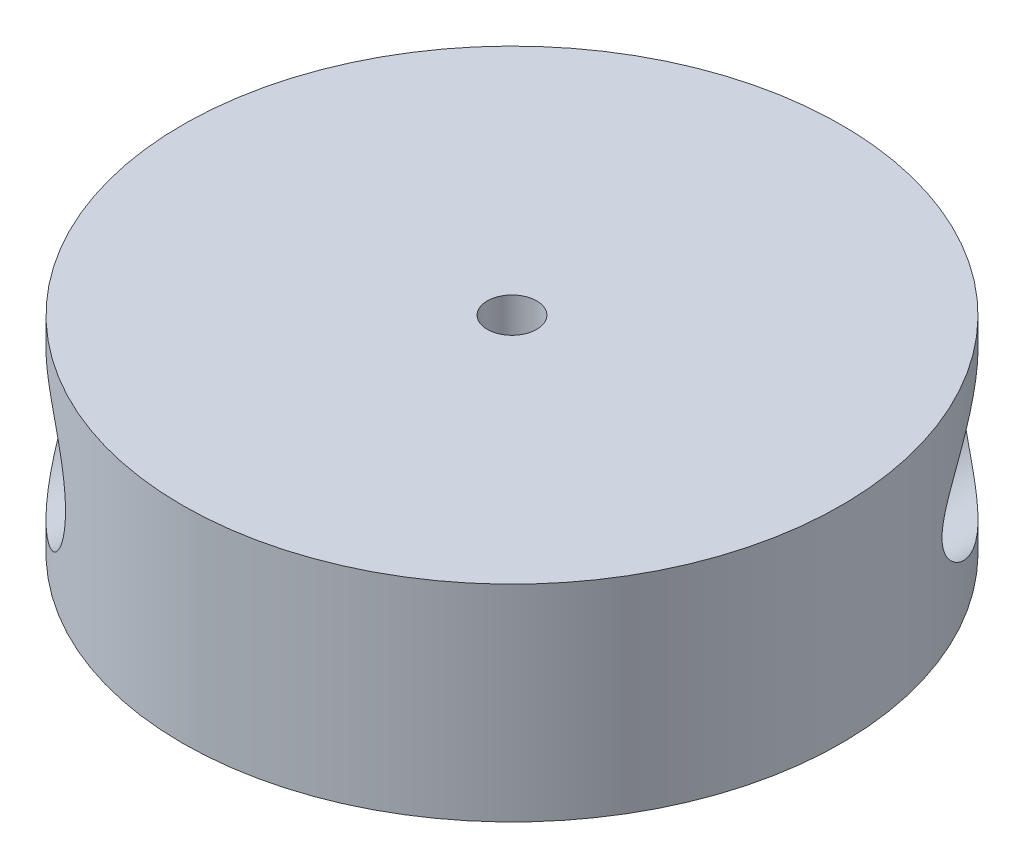
ISO-10303-21;
HEADER;
FILE_DESCRIPTION(('STEP AP214'),'2;1');
FILE_NAME('part.step','',(''),(''),'','','');
FILE_SCHEMA(('AUTOMOTIVE_DESIGN { 1 0 10303 214 1 1 1 1 }'));
ENDSEC;
DATA;
#1=APPLICATION_CONTEXT('core data for automotive mechanical design processes');
#2=APPLICATION_PROTOCOL_DEFINITION('international standard','automotive_design',2000,#1);
#3=PRODUCT_CONTEXT('',#1,'mechanical');
#4=PRODUCT('Part','Part','',(#3));
#5=PRODUCT_RELATED_PRODUCT_CATEGORY('part','',(#4));
#6=PRODUCT_DEFINITION_FORMATION('','',#4);
#7=PRODUCT_DEFINITION_CONTEXT('part definition',#1,'design');
#8=PRODUCT_DEFINITION('design','',#6,#7);
#9=PRODUCT_DEFINITION_SHAPE('','',#8);
#10=(LENGTH_UNIT() NAMED_UNIT(*) SI_UNIT(.MILLI.,.METRE.));
#11=(NAMED_UNIT(*) PLANE_ANGLE_UNIT() SI_UNIT($,.RADIAN.));
#12=(NAMED_UNIT(*) SI_UNIT($,.STERADIAN.) SOLID_ANGLE_UNIT());
#13=UNCERTAINTY_MEASURE_WITH_UNIT(LENGTH_MEASURE(1.E-05),#10,'distance_accuracy_value','');
#14=(GEOMETRIC_REPRESENTATION_CONTEXT(3) GLOBAL_UNCERTAINTY_ASSIGNED_CONTEXT((#13)) GLOBAL_UNIT_ASSIGNED_CONTEXT((#10,
#11,#12)) REPRESENTATION_CONTEXT('',''));
#15=CARTESIAN_POINT('',(0.,0.,0.));
#16=DIRECTION('',(0.,0.,1.));
#17=DIRECTION('',(1.,0.,0.));
#18=AXIS2_PLACEMENT_3D('',#15,#16,#17);
#19=CARTESIAN_POINT('',(0.,25.,0.));
#20=DIRECTION('',(0.,-1.,0.));
#21=DIRECTION('',(0.,0.,-1.));
#22=AXIS2_PLACEMENT_3D('',#19,#20,#21);
#23=CYLINDRICAL_SURFACE('',#22,40.);
#24=CARTESIAN_POINT('',(37.,12.5,-15.1986841535707));
#25=CARTESIAN_POINT('',(37.0000045072031,12.6108431152836,-15.1986713501379));
#26=CARTESIAN_POINT('',(36.9979472042589,12.7216400331114,-15.2036843253257));
#27=CARTESIAN_POINT('',(36.9898067854234,12.9422171858196,-15.2234788612822));
#28=CARTESIAN_POINT('',(36.9837231433624,13.0519972859186,-15.238261698795));
#29=CARTESIAN_POINT('',(36.959660736741,13.3786569544393,-15.2965792674699));
#30=CARTESIAN_POINT('',(36.9358708699026,13.5927040040138,-15.3540819302438));
#31=CARTESIAN_POINT('',(36.8659339826997,14.0718905655712,-15.5213784364414));
#32=CARTESIAN_POINT('',(36.8151609285029,14.332494329502,-15.6418160927595));
#33=CARTESIAN_POINT('',(36.6968331729873,14.8304450421458,-15.9174412353892));
#34=CARTESIAN_POINT('',(36.6292340779595,15.067728113975,-16.0727205391179));
#35=CARTESIAN_POINT('',(36.4862369860393,15.505504766104,-16.3946173663222));
#36=CARTESIAN_POINT('',(36.4116847102366,15.7074035772001,-16.5597404969942));
#37=CARTESIAN_POINT('',(36.2532952809628,16.0954224472309,-16.9036825639029));
#38=CARTESIAN_POINT('',(36.1694497798853,16.2815280507086,-17.0825137681726));
#39=CARTESIAN_POINT('',(35.9935827506881,16.6403643677001,-17.4500322766115));
#40=CARTESIAN_POINT('',(35.9015445809349,16.8130664594454,-17.6387393057319));
#41=CARTESIAN_POINT('',(35.7101914092421,17.1464926485604,-18.0229946473029));
#42=CARTESIAN_POINT('',(35.6108738262538,17.3072124562503,-18.2185453733443));
#43=CARTESIAN_POINT('',(35.4042343712699,17.619848076733,-18.6169594498047));
#44=CARTESIAN_POINT('',(35.2968290376024,17.7716312055275,-18.8198831762293));
#45=CARTESIAN_POINT('',(35.075471446199,18.0652031480908,-19.2292866519795));
#46=CARTESIAN_POINT('',(34.9615199891015,18.2069931793842,-19.4357659642774));
#47=CARTESIAN_POINT('',(34.7271905337633,18.4814286233928,-19.8514282049718));
#48=CARTESIAN_POINT('',(34.6068073575338,18.6140664649529,-20.0606132057521));
#49=CARTESIAN_POINT('',(34.3598520079031,18.8705538696378,-20.4807224405254));
#50=CARTESIAN_POINT('',(34.2332791570174,18.9944024670917,-20.6916468627949));
#51=CARTESIAN_POINT('',(33.8440834379609,19.3535840207692,-21.3266144526233));
#52=CARTESIAN_POINT('',(33.5722819872924,19.57620555856,-21.7523197944948));
#53=CARTESIAN_POINT('',(33.0050338548782,19.9881478310489,-22.6037509865158));
#54=CARTESIAN_POINT('',(32.7095950180221,20.1774795479741,-23.0294767833815));
#55=CARTESIAN_POINT('',(32.0780193193993,20.5316970995935,-23.9020253917821));
#56=CARTESIAN_POINT('',(31.7405256445785,20.6945942718323,-24.3486793476578));
#57=CARTESIAN_POINT('',(31.0401674045763,20.979403502543,-25.2354368619433));
#58=CARTESIAN_POINT('',(30.6772956087588,21.1013038224126,-25.6755385098191));
#59=CARTESIAN_POINT('',(29.9286616581291,21.2994191164271,-26.544361397381));
#60=CARTESIAN_POINT('',(29.5429670944621,21.3757622328435,-26.9731112851089));
#61=CARTESIAN_POINT('',(28.7502108057911,21.4775661787402,-27.8165356480106));
#62=CARTESIAN_POINT('',(28.3431636883577,21.5030613398705,-28.2312194342909));
#63=CARTESIAN_POINT('',(27.6681132214038,21.4976153844168,-28.8895665120327));
#64=CARTESIAN_POINT('',(27.4054019322987,21.4842956619246,-29.1388854043008));
#65=CARTESIAN_POINT('',(26.874604765197,21.4333387537765,-29.6291405367339));
#66=CARTESIAN_POINT('',(26.6065203974198,21.3957083108113,-29.8700790817062));
#67=CARTESIAN_POINT('',(26.0670049510278,21.2942483441872,-30.342043679682));
#68=CARTESIAN_POINT('',(25.7955771962993,21.2304430786658,-30.5730786926289));
#69=CARTESIAN_POINT('',(25.2514799115264,21.0747109722143,-31.0239826062772));
#70=CARTESIAN_POINT('',(24.9788105907893,20.9827887101597,-31.2438533183012));
#71=CARTESIAN_POINT('',(24.4847684180731,20.7885569345845,-31.6318835487794));
#72=CARTESIAN_POINT('',(24.2631087315575,20.6911984622575,-31.8021613270342));
#73=CARTESIAN_POINT('',(23.8228781083333,20.4756934998387,-32.1332581965372));
#74=CARTESIAN_POINT('',(23.6043065013825,20.3575515978897,-32.2940793649899));
#75=CARTESIAN_POINT('',(23.172410198365,20.0998429161509,-32.6053719022818));
#76=CARTESIAN_POINT('',(22.9590859086749,19.9602744830136,-32.7558424711333));
#77=CARTESIAN_POINT('',(22.5401883368044,19.6593957810268,-33.0454952290686));
#78=CARTESIAN_POINT('',(22.3346151680431,19.4980851941904,-33.1846772530055));
#79=CARTESIAN_POINT('',(21.932188727173,19.1522669751476,-33.4520249274819));
#80=CARTESIAN_POINT('',(21.7354278686126,18.9675680988927,-33.5800831188852));
#81=CARTESIAN_POINT('',(21.3555329163541,18.5766220521075,-33.8229516691135));
#82=CARTESIAN_POINT('',(21.1723993013604,18.370374125203,-33.9377615626237));
#83=CARTESIAN_POINT('',(20.8229183561417,17.9375378182738,-34.1533046269422));
#84=CARTESIAN_POINT('',(20.6565602321992,17.7109626968792,-34.2540468654534));
#85=CARTESIAN_POINT('',(20.3434937410878,17.2389930423448,-34.4408989035268));
#86=CARTESIAN_POINT('',(20.1967814870339,16.9936022469912,-34.5270115984152));
#87=CARTESIAN_POINT('',(19.9459515676704,16.5239622342082,-34.6724213547214));
#88=CARTESIAN_POINT('',(19.838744250121,16.3020005525501,-34.733801925554));
#89=CARTESIAN_POINT('',(19.6420982170133,15.8476452016096,-34.8453837416828));
#90=CARTESIAN_POINT('',(19.5526574395292,15.6152527467305,-34.8955862843458));
#91=CARTESIAN_POINT('',(19.3928987281098,15.1419988177376,-34.9846230369219));
#92=CARTESIAN_POINT('',(19.3225716950115,14.9011414352712,-35.0234626568686));
#93=CARTESIAN_POINT('',(19.2020451311343,14.4129034102075,-35.089688024084));
#94=CARTESIAN_POINT('',(19.1518443351186,14.1655231787119,-35.1170744913602));
#95=CARTESIAN_POINT('',(19.0761374349304,13.690339004831,-35.158251415114));
#96=CARTESIAN_POINT('',(19.0487280967915,13.4629267172384,-35.1730920335619));
#97=CARTESIAN_POINT('',(19.0113311020144,13.0062649146192,-35.1933196541369));
#98=CARTESIAN_POINT('',(19.0013421685075,12.777015535484,-35.1987073491381));
#99=CARTESIAN_POINT('',(18.9989110187242,12.3184552859338,-35.2000196117023));
#100=CARTESIAN_POINT('',(19.0064644870712,12.0891444445139,-35.1959465065929));
#101=CARTESIAN_POINT('',(19.0390136400899,11.6321279387729,-35.1783498954311));
#102=CARTESIAN_POINT('',(19.0640093346794,11.4044222753646,-35.164826384005));
#103=CARTESIAN_POINT('',(19.1302019567802,10.9585476152475,-35.1288591457952));
#104=CARTESIAN_POINT('',(19.1709338303101,10.7402886677646,-35.1066712913861));
#105=CARTESIAN_POINT('',(19.268109448738,10.308407870724,-35.0534309875676));
#106=CARTESIAN_POINT('',(19.3245527424073,10.0947858881837,-35.0223787927394));
#107=CARTESIAN_POINT('',(19.4524887778917,9.67360812450569,-34.9514809759876));
#108=CARTESIAN_POINT('',(19.5239809666768,9.46605212076921,-34.9116356771982));
#109=CARTESIAN_POINT('',(19.6811933854186,9.05831420702551,-34.8232501692938));
#110=CARTESIAN_POINT('',(19.7669139073819,8.85813244846213,-34.7747097817288));
#111=CARTESIAN_POINT('',(19.9533971464668,8.4625612548978,-34.6680500548595));
#112=CARTESIAN_POINT('',(20.0544178095868,8.26733841015929,-34.6097642104359));
#113=CARTESIAN_POINT('',(20.2690875492605,7.88689900168679,-34.4844824066083));
#114=CARTESIAN_POINT('',(20.3827366893247,7.70168248828308,-34.4174864033995));
#115=CARTESIAN_POINT('',(20.6214275435732,7.34216817341632,-34.275006021613));
#116=CARTESIAN_POINT('',(20.7464701228109,7.16787120272424,-34.1995209983996));
#117=CARTESIAN_POINT('',(21.0066419844635,6.83093861738803,-34.0403326749743));
#118=CARTESIAN_POINT('',(21.1417722770976,6.66830417387667,-33.9566285514072));
#119=CARTESIAN_POINT('',(21.4302627366067,6.34462116227357,-33.7753576773817));
#120=CARTESIAN_POINT('',(21.5842376965373,6.18443178389804,-33.6772353864629));
#121=CARTESIAN_POINT('',(21.9005351662477,5.87844760505177,-33.4724074202802));
#122=CARTESIAN_POINT('',(22.0628579887655,5.7326533444671,-33.3657014233582));
#123=CARTESIAN_POINT('',(22.3943020412543,5.4556543106577,-33.1441544031586));
#124=CARTESIAN_POINT('',(22.563424511992,5.32445221674202,-33.0293118922288));
#125=CARTESIAN_POINT('',(22.9069546970827,5.07667501847207,-32.7919963186145));
#126=CARTESIAN_POINT('',(23.0813630027431,4.96010155812467,-32.6695224006016));
#127=CARTESIAN_POINT('',(23.4570066370483,4.72721487036659,-32.4010618836761));
#128=CARTESIAN_POINT('',(23.658780937304,4.6129072825629,-32.2540889138823));
#129=CARTESIAN_POINT('',(24.0654589660152,4.40235640979585,-31.9518058750952));
#130=CARTESIAN_POINT('',(24.2703628730113,4.30611415963398,-31.7964953291717));
#131=CARTESIAN_POINT('',(24.6817909849732,4.13103992566455,-31.478196552103));
#132=CARTESIAN_POINT('',(24.8883159147716,4.05221625091535,-31.3152047015842));
#133=CARTESIAN_POINT('',(25.3015189895178,3.91129404116863,-30.9823110779873));
#134=CARTESIAN_POINT('',(25.5081971561604,3.84919869566456,-30.8124079942823));
#135=CARTESIAN_POINT('',(26.0301672858226,3.71214749122754,-30.3743332383091));
#136=CARTESIAN_POINT('',(26.3447780593407,3.64790941534553,-30.1019462332687));
#137=CARTESIAN_POINT('',(26.9681440471953,3.553786944403,-29.5447832382046));
#138=CARTESIAN_POINT('',(27.2768968045659,3.52391666372415,-29.2600022079178));
#139=CARTESIAN_POINT('',(27.8864648087216,3.4955372813486,-28.6796520533917));
#140=CARTESIAN_POINT('',(28.1872663353128,3.49707924309852,-28.3840661433973));
#141=CARTESIAN_POINT('',(28.778563043066,3.52885127857682,-27.7843794753909));
#142=CARTESIAN_POINT('',(29.0690583389557,3.55908103285222,-27.4802788122316));
#143=CARTESIAN_POINT('',(29.7375958429205,3.660796446404,-26.7580707262374));
#144=CARTESIAN_POINT('',(30.1109420960146,3.74297506459475,-26.3371015445488));
#145=CARTESIAN_POINT('',(30.8347326692886,3.94979230861812,-25.4859119498377));
#146=CARTESIAN_POINT('',(31.1851673555923,4.07444866040562,-25.0556877450271));
#147=CARTESIAN_POINT('',(31.8626880929815,4.36270936247262,-24.1882755905291));
#148=CARTESIAN_POINT('',(32.1897173872464,4.52640447885083,-23.7510736613961));
#149=CARTESIAN_POINT('',(32.8187654260242,4.89003888499048,-22.8739964449012));
#150=CARTESIAN_POINT('',(33.120791610024,5.08996733692103,-22.4341219948444));
#151=CARTESIAN_POINT('',(33.655587848611,5.49224286565266,-21.6217680752923));
#152=CARTESIAN_POINT('',(33.8919203141087,5.68964119510486,-21.2491675975308));
#153=CARTESIAN_POINT('',(34.3460101011823,6.11062171502132,-20.5070876523662));
#154=CARTESIAN_POINT('',(34.5637607266454,6.33421327612938,-20.1376093529167));
#155=CARTESIAN_POINT('',(34.8752938659011,6.69009781002409,-19.5897383862481));
#156=CARTESIAN_POINT('',(34.9764034384775,6.81183322913305,-19.4085894645883));
#157=CARTESIAN_POINT('',(35.1736667139573,7.06272229978002,-19.0487590870299));
#158=CARTESIAN_POINT('',(35.2698210094527,7.19187506036838,-18.8700773379665));
#159=CARTESIAN_POINT('',(35.4569076918545,7.45807847715172,-18.5161480295052));
#160=CARTESIAN_POINT('',(35.5478442512357,7.59512264200706,-18.3408978020368));
#161=CARTESIAN_POINT('',(35.7242837551183,7.87796252882122,-17.994811486061));
#162=CARTESIAN_POINT('',(35.8097879360095,8.02375624461812,-17.8239743984293));
#163=CARTESIAN_POINT('',(35.95117473114,8.28173309355913,-17.536556185572));
#164=CARTESIAN_POINT('',(36.0084969182743,8.39150495273535,-17.4185178590613));
#165=CARTESIAN_POINT('',(36.1199726962176,8.61646977833149,-17.1861620423436));
#166=CARTESIAN_POINT('',(36.1741264730102,8.73166242583687,-17.0718443339138));
#167=CARTESIAN_POINT('',(36.2791420258644,8.96834059467959,-16.8475289514741));
#168=CARTESIAN_POINT('',(36.329993886586,9.08984326092625,-16.7375446469227));
#169=CARTESIAN_POINT('',(36.4278505224338,9.3394147134312,-16.5234847563036));
#170=CARTESIAN_POINT('',(36.4748560595931,9.4674821908527,-16.4194080010909));
#171=CARTESIAN_POINT('',(36.5652508317941,9.73296936206456,-16.2171173691255));
#172=CARTESIAN_POINT('',(36.6085696308127,9.87050645997777,-16.1190249149973));
#173=CARTESIAN_POINT('',(36.6900325392796,10.1537159148516,-15.9327288583811));
#174=CARTESIAN_POINT('',(36.7281751043086,10.2993906816059,-15.8445282086413));
#175=CARTESIAN_POINT('',(36.7981638755316,10.598482710376,-15.6812941655718));
#176=CARTESIAN_POINT('',(36.8300409407918,10.751857102869,-15.6061964538611));
#177=CARTESIAN_POINT('',(36.8865666374854,11.0666627369438,-15.4721202178616));
#178=CARTESIAN_POINT('',(36.9112238784924,11.2280841114086,-15.4131225002388));
#179=CARTESIAN_POINT('',(36.9537988375809,11.5716558827789,-15.3107842331657));
#180=CARTESIAN_POINT('',(36.9709910386468,11.7544168266097,-15.2691409073662));
#181=CARTESIAN_POINT('',(36.9940838590503,12.124831595914,-15.2131112284517));
#182=CARTESIAN_POINT('',(36.9999923749696,12.312481906407,-15.1987058136917));
#183=CARTESIAN_POINT('',(37.,12.5,-15.1986841535707));
#184=B_SPLINE_CURVE_WITH_KNOTS('',3,(#24,#25,#26,#27,#28,#29,#30,#31,#32,#33,#34,#35,#36,#37,
#38,#39,#40,#41,#42,#43,#44,#45,#46,#47,#48,#49,#50,#51,#52,#53,#54,#55,#56,#57,#58,#59,#60,#61,
#62,#63,#64,#65,#66,#67,#68,#69,#70,#71,#72,#73,#74,#75,#76,#77,#78,#79,#80,#81,#82,#83,#84,#85,
#86,#87,#88,#89,#90,#91,#92,#93,#94,#95,#96,#97,#98,#99,#100,#101,#102,#103,#104,#105,#106,#107,
#108,#109,#110,#111,#112,#113,#114,#115,#116,#117,#118,#119,#120,#121,#122,#123,#124,#125,#126,
#127,#128,#129,#130,#131,#132,#133,#134,#135,#136,#137,#138,#139,#140,#141,#142,#143,#144,#145,
#146,#147,#148,#149,#150,#151,#152,#153,#154,#155,#156,#157,#158,#159,#160,#161,#162,#163,#164,
#165,#166,#167,#168,#169,#170,#171,#172,#173,#174,#175,#176,#177,#178,#179,#180,#181,#182,#183),
.UNSPECIFIED.,.T.,.F.,(4,2,2,2,2,2,2,2,2,2,2,2,2,2,2,2,2,2,2,2,2,2,2,2,2,2,2,2,2,2,2,2,2,2,2,2,
2,2,2,2,2,2,2,2,2,2,2,2,2,2,2,2,2,2,2,2,2,2,2,2,2,2,2,2,2,2,2,2,2,2,2,2,2,2,2,2,2,2,2,4),(0.,
0.332311931144482,0.664667298032812,1.32982631366192,2.19958112038131,3.07165546831538,
3.88428425508702,4.69764899067988,5.51270534269973,6.32805209902366,7.15343270482658,
7.97871257463345,8.80466716971599,9.63071237205942,11.2849033468909,12.9385475802406,
14.685733643279,16.4334195519069,18.1761661500472,19.9177356772774,21.0042059474841,
22.0903750094351,23.1755397044651,24.2605277735494,25.1476591083206,26.0345948454841,
26.9215990562008,27.8086162410869,28.7034218360685,29.5982588493905,30.492516381234,
31.3865967242809,32.1476362409452,32.9085873822171,33.6691756330499,34.4297160619685,
35.1174871161421,35.8052077564359,36.4927592374939,37.1803111094973,37.8489311667184,
38.5175320232941,39.1861083138215,39.8546983271608,40.5361671576588,41.2176394155182,
41.8991634577401,42.5807558419838,43.308677196807,44.0366258418157,44.7647079276406,
45.4928717642336,46.315737810026,47.1386509760739,47.9619558471616,48.785417582091,
50.0467303405803,51.3085609182139,52.5724428792388,53.8363107664686,55.5398076754647,
57.2440163259047,58.9522266111478,60.6599267907055,62.10908616589,63.5587655710776,
64.2802329451982,65.0016138392588,65.7224095866573,66.4430406914561,66.9561528207809,
67.469234800461,67.9837923497726,68.4982477069403,69.0209887289511,69.5438853785129,
70.0641382874163,70.5837682490242,71.1463485710325,71.7085350419468),.UNSPECIFIED.);
#185=CARTESIAN_POINT('',(37.,12.5,-15.1986841535707));
#186=VERTEX_POINT('',#185);
#187=EDGE_CURVE('E54',#186,#186,#184,.T.);
#188=ORIENTED_EDGE('',*,*,#187,.T.);
#189=EDGE_LOOP('',(#188));
#190=FACE_BOUND('',#189,.T.);
#191=CARTESIAN_POINT('',(0.,25.,0.));
#192=DIRECTION('',(0.,1.,0.));
#193=DIRECTION('',(0.,0.,1.));
#194=AXIS2_PLACEMENT_3D('',#191,#192,#193);
#195=CIRCLE('',#194,40.);
#196=CARTESIAN_POINT('',(0.,25.,40.));
#197=VERTEX_POINT('',#196);
#198=EDGE_CURVE('E46',#197,#197,#195,.T.);
#199=ORIENTED_EDGE('',*,*,#198,.F.);
#200=EDGE_LOOP('',(#199));
#201=FACE_BOUND('',#200,.T.);
#202=CARTESIAN_POINT('',(0.,0.,0.));
#203=DIRECTION('',(0.,1.,0.));
#204=DIRECTION('',(0.,0.,1.));
#205=AXIS2_PLACEMENT_3D('',#202,#203,#204);
#206=CIRCLE('',#205,40.);
#207=CARTESIAN_POINT('',(0.,0.,40.));
#208=VERTEX_POINT('',#207);
#209=EDGE_CURVE('E51',#208,#208,#206,.T.);
#210=ORIENTED_EDGE('',*,*,#209,.T.);
#211=EDGE_LOOP('',(#210));
#212=FACE_BOUND('',#211,.T.);
#213=CARTESIAN_POINT('',(-37.,12.5,15.1986841535707));
#214=CARTESIAN_POINT('',(-37.0000045072031,12.3891568847164,15.1986713501379));
#215=CARTESIAN_POINT('',(-36.9979472042589,12.2783599668886,15.2036843253257));
#216=CARTESIAN_POINT('',(-36.9898067854234,12.0577828141804,15.2234788612822));
#217=CARTESIAN_POINT('',(-36.9837231433624,11.9480027140814,15.238261698795));
#218=CARTESIAN_POINT('',(-36.959660736741,11.6213430455607,15.2965792674699));
#219=CARTESIAN_POINT('',(-36.9358708699026,11.4072959959862,15.3540819302438));
#220=CARTESIAN_POINT('',(-36.8659339826997,10.9281094344288,15.5213784364414));
#221=CARTESIAN_POINT('',(-36.8151609285029,10.667505670498,15.6418160927595));
#222=CARTESIAN_POINT('',(-36.6968331729873,10.1695549578542,15.9174412353892));
#223=CARTESIAN_POINT('',(-36.6292340779595,9.93227188602497,16.0727205391179));
#224=CARTESIAN_POINT('',(-36.4862369860393,9.49449523389601,16.3946173663222));
#225=CARTESIAN_POINT('',(-36.4116847102366,9.29259642279992,16.5597404969942));
#226=CARTESIAN_POINT('',(-36.2532952809628,8.90457755276911,16.9036825639029));
#227=CARTESIAN_POINT('',(-36.1694497798853,8.71847194929141,17.0825137681725));
#228=CARTESIAN_POINT('',(-35.9935827506881,8.35963563229991,17.4500322766115));
#229=CARTESIAN_POINT('',(-35.9015445809349,8.18693354055462,17.6387393057319));
#230=CARTESIAN_POINT('',(-35.7101914092421,7.85350735143959,18.0229946473029));
#231=CARTESIAN_POINT('',(-35.6108738262538,7.69278754374965,18.2185453733443));
#232=CARTESIAN_POINT('',(-35.4042343712699,7.38015192326699,18.6169594498047));
#233=CARTESIAN_POINT('',(-35.2968290376024,7.2283687944725,18.8198831762293));
#234=CARTESIAN_POINT('',(-35.075471446199,6.93479685190918,19.2292866519795));
#235=CARTESIAN_POINT('',(-34.9615199891015,6.79300682061577,19.4357659642774));
#236=CARTESIAN_POINT('',(-34.7271905337633,6.51857137660724,19.8514282049718));
#237=CARTESIAN_POINT('',(-34.6068073575338,6.38593353504709,20.0606132057521));
#238=CARTESIAN_POINT('',(-34.3598520079031,6.12944613036222,20.4807224405254));
#239=CARTESIAN_POINT('',(-34.2332791570174,6.00559753290827,20.6916468627949));
#240=CARTESIAN_POINT('',(-33.8440834379609,5.64641597923084,21.3266144526233));
#241=CARTESIAN_POINT('',(-33.5722819872924,5.42379444144001,21.7523197944948));
#242=CARTESIAN_POINT('',(-33.0050338548782,5.01185216895105,22.6037509865158));
#243=CARTESIAN_POINT('',(-32.709595018022,4.82252045202591,23.0294767833815));
#244=CARTESIAN_POINT('',(-32.0780193193993,4.46830290040653,23.9020253917821));
#245=CARTESIAN_POINT('',(-31.7405256445785,4.30540572816772,24.3486793476578));
#246=CARTESIAN_POINT('',(-31.0401674045762,4.02059649745698,25.2354368619433));
#247=CARTESIAN_POINT('',(-30.6772956087588,3.89869617758742,25.6755385098191));
#248=CARTESIAN_POINT('',(-29.9286616581291,3.70058088357287,26.544361397381));
#249=CARTESIAN_POINT('',(-29.5429670944621,3.62423776715646,26.9731112851089));
#250=CARTESIAN_POINT('',(-28.7502108057911,3.52243382125983,27.8165356480106));
#251=CARTESIAN_POINT('',(-28.3431636883577,3.49693866012949,28.231219434291));
#252=CARTESIAN_POINT('',(-27.6681132214038,3.50238461558322,28.8895665120327));
#253=CARTESIAN_POINT('',(-27.4054019322986,3.51570433807536,29.1388854043008));
#254=CARTESIAN_POINT('',(-26.874604765197,3.56666124622346,29.629140536734));
#255=CARTESIAN_POINT('',(-26.6065203974198,3.60429168918875,29.8700790817062));
#256=CARTESIAN_POINT('',(-26.0670049510278,3.70575165581282,30.342043679682));
#257=CARTESIAN_POINT('',(-25.7955771962992,3.76955692133417,30.5730786926289));
#258=CARTESIAN_POINT('',(-25.2514799115264,3.92528902778571,31.0239826062773));
#259=CARTESIAN_POINT('',(-24.9788105907893,4.01721128984029,31.2438533183012));
#260=CARTESIAN_POINT('',(-24.4847684180731,4.21144306541551,31.6318835487794));
#261=CARTESIAN_POINT('',(-24.2631087315575,4.30880153774254,31.8021613270342));
#262=CARTESIAN_POINT('',(-23.8228781083333,4.52430650016134,32.1332581965373));
#263=CARTESIAN_POINT('',(-23.6043065013825,4.64244840211034,32.2940793649899));
#264=CARTESIAN_POINT('',(-23.172410198365,4.90015708384914,32.6053719022818));
#265=CARTESIAN_POINT('',(-22.9590859086749,5.03972551698643,32.7558424711333));
#266=CARTESIAN_POINT('',(-22.5401883368044,5.34060421897319,33.0454952290686));
#267=CARTESIAN_POINT('',(-22.3346151680431,5.50191480580964,33.1846772530055));
#268=CARTESIAN_POINT('',(-21.932188727173,5.84773302485243,33.4520249274819));
#269=CARTESIAN_POINT('',(-21.7354278686126,6.03243190110729,33.5800831188853));
#270=CARTESIAN_POINT('',(-21.3555329163541,6.42337794789249,33.8229516691135));
#271=CARTESIAN_POINT('',(-21.1723993013604,6.62962587479705,33.9377615626237));
#272=CARTESIAN_POINT('',(-20.8229183561417,7.06246218172628,34.1533046269422));
#273=CARTESIAN_POINT('',(-20.6565602321992,7.28903730312084,34.2540468654535));
#274=CARTESIAN_POINT('',(-20.3434937410878,7.76100695765527,34.4408989035268));
#275=CARTESIAN_POINT('',(-20.1967814870339,8.0063977530088,34.5270115984152));
#276=CARTESIAN_POINT('',(-19.9459515676704,8.47603776579182,34.6724213547215));
#277=CARTESIAN_POINT('',(-19.838744250121,8.69799944744994,34.733801925554));
#278=CARTESIAN_POINT('',(-19.6420982170133,9.15235479839041,34.8453837416828));
#279=CARTESIAN_POINT('',(-19.5526574395292,9.38474725326948,34.8955862843458));
#280=CARTESIAN_POINT('',(-19.3928987281098,9.85800118226239,34.984623036922));
#281=CARTESIAN_POINT('',(-19.3225716950115,10.0988585647289,35.0234626568686));
#282=CARTESIAN_POINT('',(-19.2020451311343,10.5870965897925,35.089688024084));
#283=CARTESIAN_POINT('',(-19.1518443351186,10.8344768212882,35.1170744913602));
#284=CARTESIAN_POINT('',(-19.0761374349304,11.309660995169,35.158251415114));
#285=CARTESIAN_POINT('',(-19.0487280967915,11.5370732827617,35.1730920335619));
#286=CARTESIAN_POINT('',(-19.0113311020144,11.9937350853808,35.1933196541369));
#287=CARTESIAN_POINT('',(-19.0013421685075,12.222984464516,35.1987073491381));
#288=CARTESIAN_POINT('',(-18.9989110187242,12.6815447140662,35.2000196117023));
#289=CARTESIAN_POINT('',(-19.0064644870712,12.9108555554862,35.1959465065929));
#290=CARTESIAN_POINT('',(-19.0390136400899,13.3678720612272,35.1783498954311));
#291=CARTESIAN_POINT('',(-19.0640093346794,13.5955777246355,35.164826384005));
#292=CARTESIAN_POINT('',(-19.1302019567802,14.0414523847526,35.1288591457951));
#293=CARTESIAN_POINT('',(-19.1709338303101,14.2597113322355,35.1066712913861));
#294=CARTESIAN_POINT('',(-19.268109448738,14.691592129276,35.0534309875676));
#295=CARTESIAN_POINT('',(-19.3245527424073,14.9052141118164,35.0223787927394));
#296=CARTESIAN_POINT('',(-19.4524887778917,15.3263918754943,34.9514809759876));
#297=CARTESIAN_POINT('',(-19.5239809666768,15.5339478792308,34.9116356771982));
#298=CARTESIAN_POINT('',(-19.6811933854186,15.9416857929745,34.8232501692938));
#299=CARTESIAN_POINT('',(-19.7669139073819,16.1418675515379,34.7747097817289));
#300=CARTESIAN_POINT('',(-19.9533971464668,16.5374387451022,34.6680500548595));
#301=CARTESIAN_POINT('',(-20.0544178095868,16.7326615898407,34.6097642104359));
#302=CARTESIAN_POINT('',(-20.2690875492605,17.1131009983132,34.4844824066083));
#303=CARTESIAN_POINT('',(-20.3827366893247,17.2983175117169,34.4174864033994));
#304=CARTESIAN_POINT('',(-20.6214275435732,17.6578318265837,34.275006021613));
#305=CARTESIAN_POINT('',(-20.7464701228109,17.8321287972758,34.1995209983996));
#306=CARTESIAN_POINT('',(-21.0066419844635,18.169061382612,34.0403326749743));
#307=CARTESIAN_POINT('',(-21.1417722770976,18.3316958261233,33.9566285514072));
#308=CARTESIAN_POINT('',(-21.4302627366067,18.6553788377265,33.7753576773817));
#309=CARTESIAN_POINT('',(-21.5842376965373,18.815568216102,33.6772353864629));
#310=CARTESIAN_POINT('',(-21.9005351662477,19.1215523949483,33.4724074202801));
#311=CARTESIAN_POINT('',(-22.0628579887655,19.2673466555329,33.3657014233582));
#312=CARTESIAN_POINT('',(-22.3943020412543,19.5443456893423,33.1441544031586));
#313=CARTESIAN_POINT('',(-22.563424511992,19.675547783258,33.0293118922288));
#314=CARTESIAN_POINT('',(-22.9069546970827,19.9233249815279,32.7919963186145));
#315=CARTESIAN_POINT('',(-23.0813630027431,20.0398984418753,32.6695224006016));
#316=CARTESIAN_POINT('',(-23.4570066370483,20.2727851296334,32.4010618836761));
#317=CARTESIAN_POINT('',(-23.658780937304,20.3870927174371,32.2540889138822));
#318=CARTESIAN_POINT('',(-24.0654589660152,20.5976435902042,31.9518058750951));
#319=CARTESIAN_POINT('',(-24.2703628730113,20.693885840366,31.7964953291717));
#320=CARTESIAN_POINT('',(-24.6817909849732,20.8689600743355,31.478196552103));
#321=CARTESIAN_POINT('',(-24.8883159147716,20.9477837490847,31.3152047015842));
#322=CARTESIAN_POINT('',(-25.3015189895178,21.0887059588314,30.9823110779873));
#323=CARTESIAN_POINT('',(-25.5081971561604,21.1508013043354,30.8124079942822));
#324=CARTESIAN_POINT('',(-26.0301672858226,21.2878525087725,30.374333238309));
#325=CARTESIAN_POINT('',(-26.3447780593407,21.3520905846545,30.1019462332687));
#326=CARTESIAN_POINT('',(-26.9681440471953,21.446213055597,29.5447832382046));
#327=CARTESIAN_POINT('',(-27.276896804566,21.4760833362759,29.2600022079178));
#328=CARTESIAN_POINT('',(-27.8864648087217,21.5044627186514,28.6796520533917));
#329=CARTESIAN_POINT('',(-28.1872663353128,21.5029207569015,28.3840661433973));
#330=CARTESIAN_POINT('',(-28.778563043066,21.4711487214232,27.7843794753909));
#331=CARTESIAN_POINT('',(-29.0690583389557,21.4409189671478,27.4802788122315));
#332=CARTESIAN_POINT('',(-29.7375958429205,21.339203553596,26.7580707262373));
#333=CARTESIAN_POINT('',(-30.1109420960146,21.2570249354052,26.3371015445487));
#334=CARTESIAN_POINT('',(-30.8347326692886,21.0502076913819,25.4859119498377));
#335=CARTESIAN_POINT('',(-31.1851673555923,20.9255513395944,25.055687745027));
#336=CARTESIAN_POINT('',(-31.8626880929816,20.6372906375274,24.1882755905291));
#337=CARTESIAN_POINT('',(-32.1897173872464,20.4735955211492,23.751073661396));
#338=CARTESIAN_POINT('',(-32.8187654260242,20.1099611150095,22.8739964449011));
#339=CARTESIAN_POINT('',(-33.120791610024,19.9100326630789,22.4341219948443));
#340=CARTESIAN_POINT('',(-33.655587848611,19.5077571343473,21.6217680752923));
#341=CARTESIAN_POINT('',(-33.8919203141087,19.3103588048951,21.2491675975308));
#342=CARTESIAN_POINT('',(-34.3460101011824,18.8893782849787,20.5070876523662));
#343=CARTESIAN_POINT('',(-34.5637607266454,18.6657867238706,20.1376093529167));
#344=CARTESIAN_POINT('',(-34.8752938659011,18.3099021899759,19.5897383862481));
#345=CARTESIAN_POINT('',(-34.9764034384775,18.1881667708669,19.4085894645883));
#346=CARTESIAN_POINT('',(-35.1736667139573,17.93727770022,19.0487590870299));
#347=CARTESIAN_POINT('',(-35.2698210094527,17.8081249396316,18.8700773379665));
#348=CARTESIAN_POINT('',(-35.4569076918545,17.5419215228483,18.5161480295052));
#349=CARTESIAN_POINT('',(-35.5478442512358,17.4048773579929,18.3408978020367));
#350=CARTESIAN_POINT('',(-35.7242837551183,17.1220374711788,17.994811486061));
#351=CARTESIAN_POINT('',(-35.8097879360095,16.9762437553819,17.8239743984293));
#352=CARTESIAN_POINT('',(-35.95117473114,16.7182669064409,17.536556185572));
#353=CARTESIAN_POINT('',(-36.0084969182743,16.6084950472647,17.4185178590613));
#354=CARTESIAN_POINT('',(-36.1199726962176,16.3835302216685,17.1861620423436));
#355=CARTESIAN_POINT('',(-36.1741264730102,16.2683375741631,17.0718443339138));
#356=CARTESIAN_POINT('',(-36.2791420258644,16.0316594053204,16.8475289514741));
#357=CARTESIAN_POINT('',(-36.329993886586,15.9101567390737,16.7375446469227));
#358=CARTESIAN_POINT('',(-36.4278505224338,15.6605852865688,16.5234847563036));
#359=CARTESIAN_POINT('',(-36.4748560595931,15.5325178091473,16.4194080010909));
#360=CARTESIAN_POINT('',(-36.5652508317941,15.2670306379354,16.2171173691255));
#361=CARTESIAN_POINT('',(-36.6085696308127,15.1294935400222,16.1190249149973));
#362=CARTESIAN_POINT('',(-36.6900325392796,14.8462840851484,15.9327288583811));
#363=CARTESIAN_POINT('',(-36.7281751043086,14.7006093183941,15.8445282086413));
#364=CARTESIAN_POINT('',(-36.7981638755316,14.401517289624,15.6812941655718));
#365=CARTESIAN_POINT('',(-36.8300409407918,14.248142897131,15.6061964538611));
#366=CARTESIAN_POINT('',(-36.8865666374854,13.9333372630563,15.4721202178616));
#367=CARTESIAN_POINT('',(-36.9112238784924,13.7719158885914,15.4131225002388));
#368=CARTESIAN_POINT('',(-36.9537988375809,13.4283441172211,15.3107842331657));
#369=CARTESIAN_POINT('',(-36.9709910386468,13.2455831733903,15.2691409073662));
#370=CARTESIAN_POINT('',(-36.9940838590503,12.875168404086,15.2131112284517));
#371=CARTESIAN_POINT('',(-36.9999923749696,12.687518093593,15.1987058136917));
#372=CARTESIAN_POINT('',(-37.,12.5,15.1986841535707));
#373=B_SPLINE_CURVE_WITH_KNOTS('',3,(#213,#214,#215,#216,#217,#218,#219,#220,#221,#222,#223,
#224,#225,#226,#227,#228,#229,#230,#231,#232,#233,#234,#235,#236,#237,#238,#239,#240,#241,#242,
#243,#244,#245,#246,#247,#248,#249,#250,#251,#252,#253,#254,#255,#256,#257,#258,#259,#260,#261,
#262,#263,#264,#265,#266,#267,#268,#269,#270,#271,#272,#273,#274,#275,#276,#277,#278,#279,#280,
#281,#282,#283,#284,#285,#286,#287,#288,#289,#290,#291,#292,#293,#294,#295,#296,#297,#298,#299,
#300,#301,#302,#303,#304,#305,#306,#307,#308,#309,#310,#311,#312,#313,#314,#315,#316,#317,#318,
#319,#320,#321,#322,#323,#324,#325,#326,#327,#328,#329,#330,#331,#332,#333,#334,#335,#336,#337,
#338,#339,#340,#341,#342,#343,#344,#345,#346,#347,#348,#349,#350,#351,#352,#353,#354,#355,#356,
#357,#358,#359,#360,#361,#362,#363,#364,#365,#366,#367,#368,#369,#370,#371,#372),.UNSPECIFIED.,
.T.,.F.,(4,2,2,2,2,2,2,2,2,2,2,2,2,2,2,2,2,2,2,2,2,2,2,2,2,2,2,2,2,2,2,2,2,2,2,2,2,2,2,2,2,2,2,
2,2,2,2,2,2,2,2,2,2,2,2,2,2,2,2,2,2,2,2,2,2,2,2,2,2,2,2,2,2,2,2,2,2,2,2,4),(0.,
0.332311931144482,0.664667298032812,1.32982631366192,2.19958112038131,3.07165546831538,
3.88428425508702,4.69764899067988,5.51270534269973,6.32805209902366,7.15343270482657,
7.97871257463345,8.80466716971599,9.63071237205942,11.2849033468909,12.9385475802406,
14.685733643279,16.4334195519069,18.1761661500472,19.9177356772774,21.0042059474841,
22.0903750094351,23.1755397044651,24.2605277735494,25.1476591083206,26.0345948454841,
26.9215990562009,27.8086162410869,28.7034218360685,29.5982588493906,30.492516381234,
31.3865967242809,32.1476362409453,32.9085873822172,33.6691756330499,34.4297160619686,
35.1174871161421,35.8052077564359,36.4927592374939,37.1803111094973,37.8489311667185,
38.5175320232942,39.1861083138215,39.8546983271609,40.5361671576588,41.2176394155182,
41.8991634577402,42.5807558419838,43.3086771968071,44.0366258418157,44.7647079276407,
45.4928717642337,46.3157378100261,47.138650976074,47.9619558471617,48.7854175820911,
50.0467303405804,51.308560918214,52.5724428792389,53.8363107664687,55.5398076754648,
57.2440163259048,58.9522266111479,60.6599267907056,62.1090861658901,63.5587655710776,
64.2802329451983,65.0016138392588,65.7224095866573,66.4430406914561,66.9561528207809,
67.469234800461,67.9837923497726,68.4982477069403,69.0209887289511,69.5438853785129,
70.0641382874164,70.5837682490242,71.1463485710325,71.7085350419468),.UNSPECIFIED.);
#374=CARTESIAN_POINT('',(-37.,12.5,15.1986841535707));
#375=VERTEX_POINT('',#374);
#376=EDGE_CURVE('E38',#375,#375,#373,.T.);
#377=ORIENTED_EDGE('',*,*,#376,.F.);
#378=EDGE_LOOP('',(#377));
#379=FACE_BOUND('',#378,.T.);
#380=ADVANCED_FACE('F34',(#190,#201,#212,#379),#23,.T.);
#381=CARTESIAN_POINT('',(0.,0.,0.));
#382=DIRECTION('',(0.,1.,0.));
#383=DIRECTION('',(0.,0.,1.));
#384=AXIS2_PLACEMENT_3D('',#381,#382,#383);
#385=PLANE('',#384);
#386=ORIENTED_EDGE('',*,*,#209,.F.);
#387=EDGE_LOOP('',(#386));
#388=FACE_BOUND('',#387,.T.);
#389=CARTESIAN_POINT('',(0.,0.,0.));
#390=DIRECTION('',(0.,1.,0.));
#391=DIRECTION('',(0.,0.,1.));
#392=AXIS2_PLACEMENT_3D('',#389,#390,#391);
#393=CIRCLE('',#392,7.);
#394=CARTESIAN_POINT('',(0.,0.,7.));
#395=VERTEX_POINT('',#394);
#396=EDGE_CURVE('E10',#395,#395,#393,.F.);
#397=ORIENTED_EDGE('',*,*,#396,.F.);
#398=EDGE_LOOP('',(#397));
#399=FACE_BOUND('',#398,.T.);
#400=ADVANCED_FACE('F83',(#388,#399),#385,.F.);
#401=CARTESIAN_POINT('',(0.,25.,0.));
#402=DIRECTION('',(0.,1.,0.));
#403=DIRECTION('',(0.,0.,1.));
#404=AXIS2_PLACEMENT_3D('',#401,#402,#403);
#405=PLANE('',#404);
#406=ORIENTED_EDGE('',*,*,#198,.T.);
#407=EDGE_LOOP('',(#406));
#408=FACE_BOUND('',#407,.T.);
#409=CARTESIAN_POINT('',(0.,25.,0.));
#410=DIRECTION('',(0.,1.,0.));
#411=DIRECTION('',(0.,0.,1.));
#412=AXIS2_PLACEMENT_3D('',#409,#410,#411);
#413=CIRCLE('',#412,3.);
#414=CARTESIAN_POINT('',(0.,25.,3.));
#415=VERTEX_POINT('',#414);
#416=EDGE_CURVE('E95',#415,#415,#413,.T.);
#417=ORIENTED_EDGE('',*,*,#416,.F.);
#418=EDGE_LOOP('',(#417));
#419=FACE_BOUND('',#418,.T.);
#420=ADVANCED_FACE('F80',(#408,#419),#405,.T.);
#421=CARTESIAN_POINT('',(0.,25.,0.));
#422=DIRECTION('',(0.,-1.,0.));
#423=DIRECTION('',(0.,0.,-1.));
#424=AXIS2_PLACEMENT_3D('',#421,#422,#423);
#425=CYLINDRICAL_SURFACE('',#424,3.);
#426=ORIENTED_EDGE('',*,*,#416,.T.);
#427=EDGE_LOOP('',(#426));
#428=FACE_BOUND('',#427,.T.);
#429=CARTESIAN_POINT('',(0.,-15.,0.));
#430=DIRECTION('',(0.,-1.,0.));
#431=DIRECTION('',(0.,0.,-1.));
#432=AXIS2_PLACEMENT_3D('',#429,#430,#431);
#433=CIRCLE('',#432,3.);
#434=CARTESIAN_POINT('',(0.,-15.,-3.));
#435=VERTEX_POINT('',#434);
#436=EDGE_CURVE('E60',#435,#435,#433,.T.);
#437=ORIENTED_EDGE('',*,*,#436,.T.);
#438=EDGE_LOOP('',(#437));
#439=FACE_BOUND('',#438,.T.);
#440=ADVANCED_FACE('F73',(#428,#439),#425,.F.);
#441=CARTESIAN_POINT('',(0.,-15.,0.));
#442=DIRECTION('',(0.,-1.,0.));
#443=DIRECTION('',(0.,0.,-1.));
#444=AXIS2_PLACEMENT_3D('',#441,#442,#443);
#445=PLANE('',#444);
#446=CARTESIAN_POINT('',(0.,-15.,0.));
#447=DIRECTION('',(0.,-1.,0.));
#448=DIRECTION('',(0.,0.,-1.));
#449=AXIS2_PLACEMENT_3D('',#446,#447,#448);
#450=CIRCLE('',#449,7.);
#451=CARTESIAN_POINT('',(0.,-15.,-7.));
#452=VERTEX_POINT('',#451);
#453=EDGE_CURVE('E97',#452,#452,#450,.T.);
#454=ORIENTED_EDGE('',*,*,#453,.T.);
#455=EDGE_LOOP('',(#454));
#456=FACE_BOUND('',#455,.T.);
#457=ORIENTED_EDGE('',*,*,#436,.F.);
#458=EDGE_LOOP('',(#457));
#459=FACE_BOUND('',#458,.T.);
#460=ADVANCED_FACE('F70',(#456,#459),#445,.T.);
#461=CARTESIAN_POINT('',(0.,-15.,0.));
#462=DIRECTION('',(0.,1.,0.));
#463=DIRECTION('',(0.,0.,1.));
#464=AXIS2_PLACEMENT_3D('',#461,#462,#463);
#465=CYLINDRICAL_SURFACE('',#464,7.);
#466=ORIENTED_EDGE('',*,*,#453,.F.);
#467=EDGE_LOOP('',(#466));
#468=FACE_BOUND('',#467,.T.);
#469=ORIENTED_EDGE('',*,*,#396,.T.);
#470=EDGE_LOOP('',(#469));
#471=FACE_BOUND('',#470,.T.);
#472=ADVANCED_FACE('F68',(#468,#471),#465,.T.);
#473=CARTESIAN_POINT('',(28.,12.5,-40.));
#474=DIRECTION('',(0.,0.,1.));
#475=DIRECTION('',(1.,0.,0.));
#476=AXIS2_PLACEMENT_3D('',#473,#474,#475);
#477=CYLINDRICAL_SURFACE('',#476,9.00000000000001);
#478=CARTESIAN_POINT('',(28.,12.5,0.));
#479=DIRECTION('',(0.,0.,1.));
#480=DIRECTION('',(1.,0.,0.));
#481=AXIS2_PLACEMENT_3D('',#478,#479,#480);
#482=CIRCLE('',#481,9.00000000000001);
#483=CARTESIAN_POINT('',(37.,12.5,0.));
#484=VERTEX_POINT('',#483);
#485=EDGE_CURVE('E61',#484,#484,#482,.T.);
#486=ORIENTED_EDGE('',*,*,#485,.T.);
#487=EDGE_LOOP('',(#486));
#488=FACE_BOUND('',#487,.T.);
#489=ORIENTED_EDGE('',*,*,#187,.F.);
#490=EDGE_LOOP('',(#489));
#491=FACE_BOUND('',#490,.T.);
#492=ADVANCED_FACE('F62',(#488,#491),#477,.F.);
#493=CARTESIAN_POINT('',(28.,12.5,0.));
#494=DIRECTION('',(0.,0.,1.));
#495=DIRECTION('',(1.,0.,0.));
#496=AXIS2_PLACEMENT_3D('',#493,#494,#495);
#497=PLANE('',#496);
#498=ORIENTED_EDGE('',*,*,#485,.F.);
#499=EDGE_LOOP('',(#498));
#500=FACE_BOUND('',#499,.T.);
#501=ADVANCED_FACE('F67',(#500),#497,.F.);
#502=CARTESIAN_POINT('',(-28.,12.5,40.));
#503=DIRECTION('',(0.,0.,-1.));
#504=DIRECTION('',(-1.,0.,0.));
#505=AXIS2_PLACEMENT_3D('',#502,#503,#504);
#506=CYLINDRICAL_SURFACE('',#505,9.00000000000001);
#507=CARTESIAN_POINT('',(-28.,12.5,0.));
#508=DIRECTION('',(0.,0.,1.));
#509=DIRECTION('',(1.,0.,0.));
#510=AXIS2_PLACEMENT_3D('',#507,#508,#509);
#511=CIRCLE('',#510,9.00000000000001);
#512=CARTESIAN_POINT('',(-19.,12.5,0.));
#513=VERTEX_POINT('',#512);
#514=EDGE_CURVE('E107',#513,#513,#511,.T.);
#515=ORIENTED_EDGE('',*,*,#514,.F.);
#516=EDGE_LOOP('',(#515));
#517=FACE_BOUND('',#516,.T.);
#518=ORIENTED_EDGE('',*,*,#376,.T.);
#519=EDGE_LOOP('',(#518));
#520=FACE_BOUND('',#519,.T.);
#521=ADVANCED_FACE('F114',(#517,#520),#506,.F.);
#522=CARTESIAN_POINT('',(-28.,12.5,0.));
#523=DIRECTION('',(0.,0.,1.));
#524=DIRECTION('',(1.,0.,0.));
#525=AXIS2_PLACEMENT_3D('',#522,#523,#524);
#526=PLANE('',#525);
#527=ORIENTED_EDGE('',*,*,#514,.T.);
#528=EDGE_LOOP('',(#527));
#529=FACE_BOUND('',#528,.T.);
#530=ADVANCED_FACE('F117',(#529),#526,.T.);
#531=CLOSED_SHELL('',(#380,#400,#420,#440,#460,#472,#492,#501,#521,#530));
#532=MANIFOLD_SOLID_BREP('B2',#531);
#533=ADVANCED_BREP_SHAPE_REPRESENTATION('',(#18,#532),#14);
#534=SHAPE_DEFINITION_REPRESENTATION(#9,#533);
ENDSEC;
END-ISO-10303-21;
